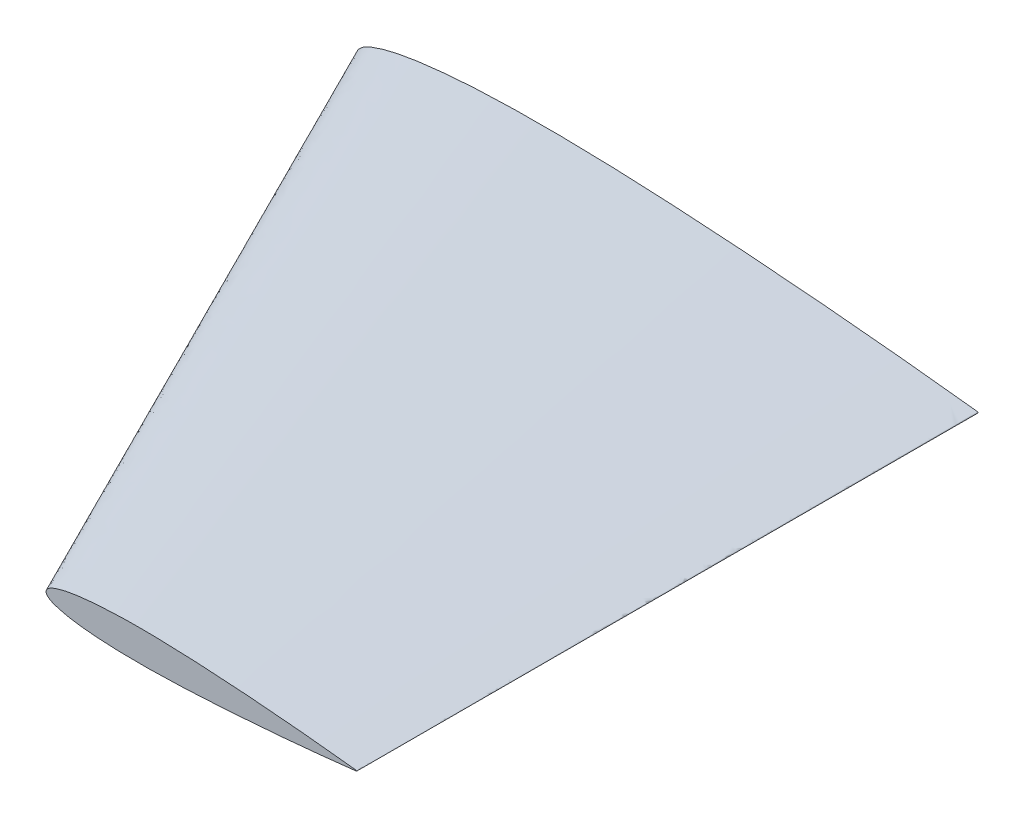
ISO-10303-21;
HEADER;
FILE_DESCRIPTION(('STEP AP214'),'2;1');
FILE_NAME('part.step','',(''),(''),'','','');
FILE_SCHEMA(('AUTOMOTIVE_DESIGN { 1 0 10303 214 1 1 1 1 }'));
ENDSEC;
DATA;
#1=APPLICATION_CONTEXT('core data for automotive mechanical design processes');
#2=APPLICATION_PROTOCOL_DEFINITION('international standard','automotive_design',2000,#1);
#3=PRODUCT_CONTEXT('',#1,'mechanical');
#4=PRODUCT('Part','Part','',(#3));
#5=PRODUCT_RELATED_PRODUCT_CATEGORY('part','',(#4));
#6=PRODUCT_DEFINITION_FORMATION('','',#4);
#7=PRODUCT_DEFINITION_CONTEXT('part definition',#1,'design');
#8=PRODUCT_DEFINITION('design','',#6,#7);
#9=PRODUCT_DEFINITION_SHAPE('','',#8);
#10=(LENGTH_UNIT() NAMED_UNIT(*) SI_UNIT(.MILLI.,.METRE.));
#11=(NAMED_UNIT(*) PLANE_ANGLE_UNIT() SI_UNIT($,.RADIAN.));
#12=(NAMED_UNIT(*) SI_UNIT($,.STERADIAN.) SOLID_ANGLE_UNIT());
#13=UNCERTAINTY_MEASURE_WITH_UNIT(LENGTH_MEASURE(1.E-05),#10,'distance_accuracy_value','');
#14=(GEOMETRIC_REPRESENTATION_CONTEXT(3) GLOBAL_UNCERTAINTY_ASSIGNED_CONTEXT((#13)) GLOBAL_UNIT_ASSIGNED_CONTEXT((#10,
#11,#12)) REPRESENTATION_CONTEXT('',''));
#15=CARTESIAN_POINT('',(0.,0.,0.));
#16=DIRECTION('',(0.,0.,1.));
#17=DIRECTION('',(1.,0.,0.));
#18=AXIS2_PLACEMENT_3D('',#15,#16,#17);
#19=CARTESIAN_POINT('',(99.9880035922591,0.,200.));
#20=DIRECTION('',(0.,0.,-1.));
#21=DIRECTION('',(-1.,0.,0.));
#22=AXIS2_PLACEMENT_3D('',#19,#20,#21);
#23=PLANE('',#22);
#24=CARTESIAN_POINT('',(199.988003592259,0.105,200.));
#25=CARTESIAN_POINT('',(198.321566070237,0.29539299037051,200.));
#26=CARTESIAN_POINT('',(194.989777362142,0.676054855597412,200.));
#27=CARTESIAN_POINT('',(188.324832977309,1.38753827363248,200.));
#28=CARTESIAN_POINT('',(179.992978200059,2.20217503777529,200.));
#29=CARTESIAN_POINT('',(169.992816568424,3.07411855616714,200.));
#30=CARTESIAN_POINT('',(159.992930711742,3.8289788496319,200.));
#31=CARTESIAN_POINT('',(149.992598890218,4.43797959820881,200.));
#32=CARTESIAN_POINT('',(139.992080610179,4.87766101565851,200.));
#33=CARTESIAN_POINT('',(131.655116581409,5.03018562008492,200.));
#34=CARTESIAN_POINT('',(124.986705080723,4.97011686452005,200.));
#35=CARTESIAN_POINT('',(119.984473263032,4.80414952889834,200.));
#36=CARTESIAN_POINT('',(114.977976518171,4.49198475948207,200.));
#37=CARTESIAN_POINT('',(110.810517860258,4.04300538643148,200.));
#38=CARTESIAN_POINT('',(107.473553513295,3.51901208947982,200.));
#39=CARTESIAN_POINT('',(104.968116669083,2.99534422126428,200.));
#40=CARTESIAN_POINT('',(102.834898031876,2.34432761088269,200.));
#41=CARTESIAN_POINT('',(101.066789196354,1.59919390956959,200.));
#42=CARTESIAN_POINT('',(99.3489969027453,0.,200.));
#43=CARTESIAN_POINT('',(101.066789196354,-1.59919390956958,200.));
#44=CARTESIAN_POINT('',(102.834898031876,-2.34432761088269,200.));
#45=CARTESIAN_POINT('',(104.968116669083,-2.99534422126428,200.));
#46=CARTESIAN_POINT('',(107.473553513295,-3.51901208947983,200.));
#47=CARTESIAN_POINT('',(110.810517860258,-4.04300538643148,200.));
#48=CARTESIAN_POINT('',(114.977976518171,-4.49198475948207,200.));
#49=CARTESIAN_POINT('',(119.984473263032,-4.80414952889834,200.));
#50=CARTESIAN_POINT('',(124.986705080723,-4.97011686452005,200.));
#51=CARTESIAN_POINT('',(131.655116581409,-5.03018562008492,200.));
#52=CARTESIAN_POINT('',(139.992080610179,-4.87766101565851,200.));
#53=CARTESIAN_POINT('',(149.992598890218,-4.43797959820881,200.));
#54=CARTESIAN_POINT('',(159.992930711742,-3.8289788496319,200.));
#55=CARTESIAN_POINT('',(169.992816568424,-3.07411855616714,200.));
#56=CARTESIAN_POINT('',(179.992978200059,-2.20217503777529,200.));
#57=CARTESIAN_POINT('',(188.324832977309,-1.38753827363248,200.));
#58=CARTESIAN_POINT('',(194.989777362142,-0.676054855597412,200.));
#59=CARTESIAN_POINT('',(198.321566070237,-0.29539299037051,200.));
#60=CARTESIAN_POINT('',(199.988003592259,-0.105,200.));
#61=B_SPLINE_CURVE_WITH_KNOTS('',3,(#24,#25,#26,#27,#28,#29,#30,#31,#32,#33,#34,#35,#36,#37,#38,
#39,#40,#41,#42,#43,#44,#45,#46,#47,#48,#49,#50,#51,#52,#53,#54,#55,#56,#57,#58,#59,#60),
.UNSPECIFIED.,.F.,.F.,(4,1,1,1,1,1,1,1,1,1,1,1,1,1,1,1,1,1,1,1,1,1,1,1,1,1,1,1,1,1,1,1,1,1,4),
(0.,0.0248223366809534,0.0496284918991712,0.0991955323846024,0.148712592973171,
0.198181861478955,0.247602780816046,0.296978032937799,0.346315468039783,0.37098206148429,
0.395661674152046,0.420379085012258,0.445195930985613,0.457685471829932,0.470302569071023,
0.483221568029035,0.490061481884537,0.5,0.509938518115463,0.516778431970965,0.529697430928977,
0.542314528170068,0.554804069014387,0.579620914987742,0.604338325847954,0.62901793851571,
0.653684531960217,0.703021967062201,0.752397219183954,0.801818138521045,0.851287407026829,
0.900804467615398,0.950371508100829,0.975177663319047,1.),.UNSPECIFIED.);
#62=CARTESIAN_POINT('',(199.987969589789,0.105003884833238,200.));
#63=VERTEX_POINT('',#62);
#64=CARTESIAN_POINT('',(199.988003592259,-0.105,200.));
#65=VERTEX_POINT('',#64);
#66=EDGE_CURVE('E89',#63,#65,#61,.T.);
#67=ORIENTED_EDGE('',*,*,#66,.T.);
#68=CARTESIAN_POINT('',(199.976007184518,0.,200.));
#69=DIRECTION('',(0.,0.,1.));
#70=DIRECTION('',(1.,0.,0.));
#71=AXIS2_PLACEMENT_3D('',#68,#69,#70);
#72=CIRCLE('',#71,0.105683081894342);
#73=EDGE_CURVE('E12',#65,#63,#72,.T.);
#74=ORIENTED_EDGE('',*,*,#73,.T.);
#75=EDGE_LOOP('',(#67,#74));
#76=FACE_BOUND('',#75,.T.);
#77=ADVANCED_FACE('F79',(#76),#23,.F.);
#78=CARTESIAN_POINT('',(0.,0.,0.));
#79=DIRECTION('',(0.,0.,-1.));
#80=DIRECTION('',(-1.,0.,0.));
#81=AXIS2_PLACEMENT_3D('',#78,#79,#80);
#82=PLANE('',#81);
#83=CARTESIAN_POINT('',(200.,0.21,0.));
#84=CARTESIAN_POINT('',(196.667124955956,0.590785980741021,0.));
#85=CARTESIAN_POINT('',(190.003547539766,1.35210971119482,0.));
#86=CARTESIAN_POINT('',(176.673658770099,2.77507654726496,0.));
#87=CARTESIAN_POINT('',(160.009949215599,4.40435007555059,0.));
#88=CARTESIAN_POINT('',(140.009625952329,6.14823711233428,0.));
#89=CARTESIAN_POINT('',(120.009854238965,7.65795769926381,0.));
#90=CARTESIAN_POINT('',(100.009190595919,8.87595919641762,0.));
#91=CARTESIAN_POINT('',(80.0081540358392,9.75532203131702,0.));
#92=CARTESIAN_POINT('',(63.3342259783001,10.0603712401698,0.));
#93=CARTESIAN_POINT('',(49.9974029769286,9.94023372904009,0.));
#94=CARTESIAN_POINT('',(39.9929393415448,9.60829905779668,0.));
#95=CARTESIAN_POINT('',(29.9799458518234,8.98396951896415,0.));
#96=CARTESIAN_POINT('',(21.6450285359974,8.08601077286296,0.));
#97=CARTESIAN_POINT('',(14.9710998420712,7.03802417895965,0.));
#98=CARTESIAN_POINT('',(9.96022615364733,5.99068844252857,0.));
#99=CARTESIAN_POINT('',(5.69378887923293,4.68865522176539,0.));
#100=CARTESIAN_POINT('',(2.15757120819012,3.19838781913917,0.));
#101=CARTESIAN_POINT('',(-1.27801337902767,0.,0.));
#102=CARTESIAN_POINT('',(2.15757120819012,-3.19838781913916,0.));
#103=CARTESIAN_POINT('',(5.69378887923293,-4.68865522176539,0.));
#104=CARTESIAN_POINT('',(9.9602261536473,-5.99068844252856,0.));
#105=CARTESIAN_POINT('',(14.9710998420712,-7.03802417895965,0.));
#106=CARTESIAN_POINT('',(21.6450285359974,-8.08601077286296,0.));
#107=CARTESIAN_POINT('',(29.9799458518234,-8.98396951896415,0.));
#108=CARTESIAN_POINT('',(39.9929393415448,-9.60829905779668,0.));
#109=CARTESIAN_POINT('',(49.9974029769286,-9.9402337290401,0.));
#110=CARTESIAN_POINT('',(63.3342259783001,-10.0603712401698,0.));
#111=CARTESIAN_POINT('',(80.0081540358392,-9.75532203131702,0.));
#112=CARTESIAN_POINT('',(100.009190595919,-8.87595919641762,0.));
#113=CARTESIAN_POINT('',(120.009854238965,-7.65795769926381,0.));
#114=CARTESIAN_POINT('',(140.009625952329,-6.14823711233428,0.));
#115=CARTESIAN_POINT('',(160.009949215599,-4.40435007555059,0.));
#116=CARTESIAN_POINT('',(176.673658770099,-2.77507654726496,0.));
#117=CARTESIAN_POINT('',(190.003547539766,-1.35210971119482,0.));
#118=CARTESIAN_POINT('',(196.667124955956,-0.59078598074102,0.));
#119=CARTESIAN_POINT('',(200.,-0.21,0.));
#120=B_SPLINE_CURVE_WITH_KNOTS('',3,(#83,#84,#85,#86,#87,#88,#89,#90,#91,#92,#93,#94,#95,#96,
#97,#98,#99,#100,#101,#102,#103,#104,#105,#106,#107,#108,#109,#110,#111,#112,#113,#114,#115,
#116,#117,#118,#119),.UNSPECIFIED.,.F.,.F.,(4,1,1,1,1,1,1,1,1,1,1,1,1,1,1,1,1,1,1,1,1,1,1,1,1,1,
1,1,1,1,1,1,1,1,4),(0.,0.0248223366809534,0.0496284918991712,0.0991955323846024,
0.148712592973171,0.198181861478955,0.247602780816046,0.296978032937799,0.346315468039783,
0.37098206148429,0.395661674152046,0.420379085012258,0.445195930985613,0.457685471829932,
0.470302569071023,0.483221568029035,0.490061481884537,0.5,0.509938518115463,0.516778431970965,
0.529697430928977,0.542314528170068,0.554804069014387,0.579620914987742,0.604338325847954,
0.62901793851571,0.653684531960217,0.703021967062201,0.752397219183954,0.801818138521045,
0.851287407026829,0.900804467615398,0.950371508100829,0.975177663319047,1.),.UNSPECIFIED.);
#121=CARTESIAN_POINT('',(200.,0.21,0.));
#122=VERTEX_POINT('',#121);
#123=CARTESIAN_POINT('',(-0.000260564519563583,0.,0.));
#124=VERTEX_POINT('',#123);
#125=EDGE_CURVE('E114',#122,#124,#120,.T.);
#126=ORIENTED_EDGE('',*,*,#125,.F.);
#127=CARTESIAN_POINT('',(199.976007184518,0.,0.));
#128=DIRECTION('',(0.,0.,1.));
#129=DIRECTION('',(-1.,0.,0.));
#130=AXIS2_PLACEMENT_3D('',#127,#128,#129);
#131=CIRCLE('',#130,0.211366163788681);
#132=CARTESIAN_POINT('',(200.,-0.21,0.));
#133=VERTEX_POINT('',#132);
#134=EDGE_CURVE('E110',#133,#122,#131,.T.);
#135=ORIENTED_EDGE('',*,*,#134,.F.);
#136=CARTESIAN_POINT('',(200.000001023805,-0.209999883028718,0.));
#137=CARTESIAN_POINT('',(200.050996332702,-0.204173592377285,0.));
#138=CARTESIAN_POINT('',(200.148345244364,-0.153822686806117,0.));
#139=CARTESIAN_POINT('',(200.2070403914,0.,0.));
#140=CARTESIAN_POINT('',(200.148345244364,0.15382268680615,0.));
#141=CARTESIAN_POINT('',(200.050996332702,0.204173592377285,0.));
#142=CARTESIAN_POINT('',(195.800720269821,0.68977401772682,0.));
#143=CARTESIAN_POINT('',(187.401641576746,1.64516184982808,0.));
#144=CARTESIAN_POINT('',(174.789671464898,2.956322722872,0.));
#145=CARTESIAN_POINT('',(164.272766230687,3.97893205131052,0.));
#146=CARTESIAN_POINT('',(155.854969345517,4.75205706207707,0.));
#147=CARTESIAN_POINT('',(149.539832633603,5.31175209047963,0.));
#148=CARTESIAN_POINT('',(143.222689879526,5.84857800095904,0.));
#149=CARTESIAN_POINT('',(136.903701624138,6.36307256009138,0.));
#150=CARTESIAN_POINT('',(130.582775851727,6.85331211165239,0.));
#151=CARTESIAN_POINT('',(124.259899708601,7.31768758751045,0.));
#152=CARTESIAN_POINT('',(117.935032822817,7.75417663460387,0.));
#153=CARTESIAN_POINT('',(111.608197401772,8.16114218860283,0.));
#154=CARTESIAN_POINT('',(105.279434318906,8.53699652167882,0.));
#155=CARTESIAN_POINT('',(98.9488261343575,8.8803963573049,0.));
#156=CARTESIAN_POINT('',(92.6164355276056,9.18929401119543,0.));
#157=CARTESIAN_POINT('',(86.2821898370826,9.45773252637092,0.));
#158=CARTESIAN_POINT('',(79.9461566660332,9.68027627810419,0.));
#159=CARTESIAN_POINT('',(73.6085096948666,9.85126068319918,0.));
#160=CARTESIAN_POINT('',(68.3260334882608,9.94507557155931,0.));
#161=CARTESIAN_POINT('',(64.0996348167972,9.98750728512888,0.));
#162=CARTESIAN_POINT('',(60.9297105529412,10.0021186371487,0.));
#163=CARTESIAN_POINT('',(57.759751504648,9.99879219447519,0.));
#164=CARTESIAN_POINT('',(54.5898716036594,9.97588273500311,0.));
#165=CARTESIAN_POINT('',(51.4202158268683,9.93145223878927,0.));
#166=CARTESIAN_POINT('',(48.2509734301157,9.86356203706924,0.));
#167=CARTESIAN_POINT('',(45.0823640405014,9.77056627044224,0.));
#168=CARTESIAN_POINT('',(41.9146515108407,9.65079009429818,0.));
#169=CARTESIAN_POINT('',(38.7481166811116,9.50303503072106,0.));
#170=CARTESIAN_POINT('',(35.5831609882451,9.32445733180193,0.));
#171=CARTESIAN_POINT('',(32.4204425911366,9.10959234759476,0.));
#172=CARTESIAN_POINT('',(29.2607655087164,8.85371909845955,0.));
#173=CARTESIAN_POINT('',(26.105150987173,8.5515731968808,0.));
#174=CARTESIAN_POINT('',(22.9549686275525,8.19704677530317,0.));
#175=CARTESIAN_POINT('',(20.3356946041292,7.85316401904582,0.));
#176=CARTESIAN_POINT('',(18.2448226181427,7.54588565238791,0.));
#177=CARTESIAN_POINT('',(16.6795546913042,7.29651821168803,0.));
#178=CARTESIAN_POINT('',(15.1178610226776,7.02562294961911,0.));
#179=CARTESIAN_POINT('',(13.5605370618068,6.73055698091506,0.));
#180=CARTESIAN_POINT('',(12.0091625285718,6.40548793846242,0.));
#181=CARTESIAN_POINT('',(10.4656928853604,6.04462605014312,0.));
#182=CARTESIAN_POINT('',(8.93226794662752,5.64302189717979,0.));
#183=CARTESIAN_POINT('',(7.41130237937513,5.1965376841113,0.));
#184=CARTESIAN_POINT('',(6.15651571806074,4.78341543529704,0.));
#185=CARTESIAN_POINT('',(5.16286887591329,4.42389832445281,0.));
#186=CARTESIAN_POINT('',(4.42287872259286,4.14005078270344,0.));
#187=CARTESIAN_POINT('',(3.69495169378208,3.82608298409513,0.));
#188=CARTESIAN_POINT('',(2.9889707830442,3.46470723497782,0.));
#189=CARTESIAN_POINT('',(2.31280112864009,3.05039546184951,0.));
#190=CARTESIAN_POINT('',(1.67195968930709,2.58262937535915,0.));
#191=CARTESIAN_POINT('',(1.07545090082835,2.06000076349657,0.));
#192=CARTESIAN_POINT('',(0.546707559185168,1.46578147876433,0.));
#193=CARTESIAN_POINT('',(0.129582414327517,0.788610549639063,0.));
#194=CARTESIAN_POINT('',(-0.065182053943121,0.,0.));
#195=CARTESIAN_POINT('',(0.129582414327572,-0.788610549639218,0.));
#196=CARTESIAN_POINT('',(0.546707559185172,-1.46578147876433,0.));
#197=CARTESIAN_POINT('',(1.07545090082836,-2.0600007634966,0.));
#198=CARTESIAN_POINT('',(1.67195968930709,-2.58262937535915,0.));
#199=CARTESIAN_POINT('',(2.31280112864016,-3.05039546184956,0.));
#200=CARTESIAN_POINT('',(2.98897078304418,-3.46470723497779,0.));
#201=CARTESIAN_POINT('',(3.69495169378215,-3.82608298409517,0.));
#202=CARTESIAN_POINT('',(4.42287872259294,-4.14005078270346,0.));
#203=CARTESIAN_POINT('',(5.16286887591325,-4.42389832445281,0.));
#204=CARTESIAN_POINT('',(6.15651571806091,-4.78341543529709,0.));
#205=CARTESIAN_POINT('',(7.41130237937512,-5.19653768411131,0.));
#206=CARTESIAN_POINT('',(8.93226794662771,-5.64302189717982,0.));
#207=CARTESIAN_POINT('',(10.4656928853605,-6.04462605014315,0.));
#208=CARTESIAN_POINT('',(12.009162528572,-6.40548793846244,0.));
#209=CARTESIAN_POINT('',(13.5605370618069,-6.73055698091511,0.));
#210=CARTESIAN_POINT('',(15.1178610226777,-7.02562294961911,0.));
#211=CARTESIAN_POINT('',(16.6795546913043,-7.29651821168806,0.));
#212=CARTESIAN_POINT('',(18.2448226181427,-7.54588565238792,0.));
#213=CARTESIAN_POINT('',(20.3356946041293,-7.85316401904584,0.));
#214=CARTESIAN_POINT('',(22.9549686275525,-8.19704677530318,0.));
#215=CARTESIAN_POINT('',(26.1051509871731,-8.55157319688081,0.));
#216=CARTESIAN_POINT('',(29.2607655087164,-8.85371909845954,0.));
#217=CARTESIAN_POINT('',(32.4204425911367,-9.10959234759479,0.));
#218=CARTESIAN_POINT('',(35.5831609882452,-9.32445733180191,0.));
#219=CARTESIAN_POINT('',(38.7481166811117,-9.50303503072109,0.));
#220=CARTESIAN_POINT('',(41.9146515108408,-9.65079009429816,0.));
#221=CARTESIAN_POINT('',(45.0823640405014,-9.77056627044227,0.));
#222=CARTESIAN_POINT('',(48.2509734301157,-9.8635620370692,0.));
#223=CARTESIAN_POINT('',(51.4202158268684,-9.9314522387893,0.));
#224=CARTESIAN_POINT('',(54.5898716036594,-9.97588273500308,0.));
#225=CARTESIAN_POINT('',(57.7597515046481,-9.99879219447521,0.));
#226=CARTESIAN_POINT('',(60.9297105529413,-10.0021186371487,0.));
#227=CARTESIAN_POINT('',(64.0996348167972,-9.98750728512887,0.));
#228=CARTESIAN_POINT('',(68.3260334882606,-9.94507557155933,0.));
#229=CARTESIAN_POINT('',(73.6085096948669,-9.85126068319915,0.));
#230=CARTESIAN_POINT('',(79.9461566660332,-9.68027627810421,0.));
#231=CARTESIAN_POINT('',(86.2821898370828,-9.45773252637091,0.));
#232=CARTESIAN_POINT('',(92.6164355276056,-9.18929401119544,0.));
#233=CARTESIAN_POINT('',(98.9488261343578,-8.88039635730488,0.));
#234=CARTESIAN_POINT('',(105.279434318906,-8.53699652167884,0.));
#235=CARTESIAN_POINT('',(111.608197401772,-8.16114218860282,0.));
#236=CARTESIAN_POINT('',(117.935032822817,-7.75417663460386,0.));
#237=CARTESIAN_POINT('',(124.259899708601,-7.31768758751044,0.));
#238=CARTESIAN_POINT('',(130.582775851728,-6.85331211165238,0.));
#239=CARTESIAN_POINT('',(136.903701624138,-6.36307256009137,0.));
#240=CARTESIAN_POINT('',(143.222689879526,-5.84857800095903,0.));
#241=CARTESIAN_POINT('',(149.539832633603,-5.3117520904796,0.));
#242=CARTESIAN_POINT('',(155.854969345518,-4.75205706207708,0.));
#243=CARTESIAN_POINT('',(164.272766230686,-3.97893205131049,0.));
#244=CARTESIAN_POINT('',(174.789671464898,-2.956322722872,0.));
#245=CARTESIAN_POINT('',(187.401641576746,-1.6451618498281,0.));
#246=CARTESIAN_POINT('',(195.800720269821,-0.689774017726812,0.));
#247=CARTESIAN_POINT('',(200.000001023805,-0.209999883028718,0.));
#248=B_SPLINE_CURVE_WITH_KNOTS('',3,(#136,#137,#138,#139,#140,#141,#142,#143,#144,#145,#146,
#147,#148,#149,#150,#151,#152,#153,#154,#155,#156,#157,#158,#159,#160,#161,#162,#163,#164,#165,
#166,#167,#168,#169,#170,#171,#172,#173,#174,#175,#176,#177,#178,#179,#180,#181,#182,#183,#184,
#185,#186,#187,#188,#189,#190,#191,#192,#193,#194,#195,#196,#197,#198,#199,#200,#201,#202,#203,
#204,#205,#206,#207,#208,#209,#210,#211,#212,#213,#214,#215,#216,#217,#218,#219,#220,#221,#222,
#223,#224,#225,#226,#227,#228,#229,#230,#231,#232,#233,#234,#235,#236,#237,#238,#239,#240,#241,
#242,#243,#244,#245,#246,#247),.UNSPECIFIED.,.T.,.F.,(4,1,1,1,2,1,1,1,1,1,1,1,1,1,1,1,1,1,1,1,1,
1,1,1,1,1,1,1,1,1,1,1,1,1,1,1,1,1,1,1,1,1,1,1,1,1,1,1,1,1,1,1,1,1,1,1,1,1,1,1,1,1,1,1,1,1,1,1,1,
1,1,1,1,1,1,1,1,1,1,1,1,1,1,1,1,1,1,1,1,1,1,1,1,1,1,1,1,1,1,1,1,1,1,1,1,1,1,1,4),(0.,
0.000378919178944327,0.000757838357888653,0.00113675753683298,0.00151567671577731,
0.0327183118184093,0.0639209469210412,0.0951235820236732,0.110724899574989,0.126326217126305,
0.141927534677621,0.157528852228937,0.173130169780253,0.188731487331569,0.204332804882885,
0.219934122434201,0.235535439985517,0.251136757536833,0.266738075088149,0.282339392639465,
0.297940710190781,0.313542027742097,0.329143345293413,0.336944004069071,0.344744662844729,
0.352545321620387,0.360345980396045,0.368146639171703,0.375947297947361,0.383747956723019,
0.391548615498677,0.399349274274335,0.407149933049993,0.414950591825651,0.422751250601309,
0.430551909376967,0.438352568152625,0.446153226928283,0.450053556316112,0.453953885703941,
0.45785421509177,0.461754544479599,0.465654873867427,0.469555203255257,0.473455532643086,
0.477355862030915,0.481256191418744,0.483206356112658,0.485156520806573,0.487106685500487,
0.489056850194402,0.491007014888316,0.492957179582231,0.494907344276145,0.49685750897006,
0.498807673663974,0.500757838357889,0.502708003051803,0.504658167745718,0.506608332439632,
0.508558497133546,0.510508661827461,0.512458826521376,0.51440899121529,0.516359155909205,
0.518309320603119,0.520259485297034,0.524159814684863,0.528060144072692,0.531960473460521,
0.535860802848349,0.539761132236179,0.543661461624008,0.547561791011837,0.551462120399665,
0.555362449787494,0.563163108563152,0.570963767338811,0.578764426114469,0.586565084890126,
0.594365743665785,0.602166402441442,0.609967061217101,0.617767719992758,0.625568378768417,
0.633369037544075,0.641169696319733,0.64897035509539,0.656771013871048,0.664571672646706,
0.672372331422364,0.68797364897368,0.703574966524996,0.719176284076312,0.734777601627628,
0.750378919178944,0.76598023673026,0.781581554281576,0.797182871832892,0.812784189384208,
0.828385506935524,0.84398682448684,0.859588142038156,0.875189459589472,0.890790777140788,
0.906392094692104,0.937594729794736,0.968797364897368,1.),.UNSPECIFIED.);
#249=EDGE_CURVE('E83',#124,#133,#248,.T.);
#250=ORIENTED_EDGE('',*,*,#249,.F.);
#251=EDGE_LOOP('',(#126,#135,#250));
#252=FACE_BOUND('',#251,.T.);
#253=ADVANCED_FACE('F123',(#252),#82,.T.);
#254=CARTESIAN_POINT('',(200.000001023805,-0.209999883028718,0.));
#255=CARTESIAN_POINT('',(199.988004104162,-0.104999941514356,200.));
#256=CARTESIAN_POINT('',(200.050996332702,-0.204173592377285,0.));
#257=CARTESIAN_POINT('',(200.01350175861,-0.10208679618864,200.));
#258=CARTESIAN_POINT('',(200.148345244364,-0.153822686806117,0.));
#259=CARTESIAN_POINT('',(200.062162161478,-0.0769668934028221,200.));
#260=CARTESIAN_POINT('',(200.2070403914,0.,0.));
#261=CARTESIAN_POINT('',(200.091536343447,0.000103589004446096,200.));
#262=CARTESIAN_POINT('',(200.148345244364,0.15382268680615,0.));
#263=CARTESIAN_POINT('',(200.062141436305,0.0768984264808553,200.));
#264=CARTESIAN_POINT('',(200.050996332702,0.204173592377285,0.));
#265=CARTESIAN_POINT('',(200.01350175861,0.10208679618864,200.));
#266=CARTESIAN_POINT('',(195.800720269821,0.68977401772682,0.));
#267=CARTESIAN_POINT('',(197.888363727169,0.34488700886341,200.));
#268=CARTESIAN_POINT('',(187.401641576746,1.64516184982808,0.));
#269=CARTESIAN_POINT('',(193.688840798275,0.822685159061327,200.));
#270=CARTESIAN_POINT('',(174.789671464898,2.956322722872,0.));
#271=CARTESIAN_POINT('',(187.382854900005,1.47826785816637,200.));
#272=CARTESIAN_POINT('',(164.272766230687,3.97893205131052,0.));
#273=CARTESIAN_POINT('',(182.124375741065,1.98930470142309,200.));
#274=CARTESIAN_POINT('',(155.854969345517,4.75205706207707,0.));
#275=CARTESIAN_POINT('',(177.915520055276,2.37624111790398,200.));
#276=CARTESIAN_POINT('',(149.539832633603,5.31175209047963,0.));
#277=CARTESIAN_POINT('',(174.757903882123,2.65565310753778,200.));
#278=CARTESIAN_POINT('',(143.222689879526,5.84857800095904,0.));
#279=CARTESIAN_POINT('',(171.599375070662,2.92443098078008,200.));
#280=CARTESIAN_POINT('',(136.903701624138,6.36307256009138,0.));
#281=CARTESIAN_POINT('',(168.439857211284,3.1814569207588,200.));
#282=CARTESIAN_POINT('',(130.582775851727,6.85331211165239,0.));
#283=CARTESIAN_POINT('',(165.2794093018,3.42669771800326,200.));
#284=CARTESIAN_POINT('',(124.259899708601,7.31768758751045,0.));
#285=CARTESIAN_POINT('',(162.117965291607,3.65882116801679,200.));
#286=CARTESIAN_POINT('',(117.935032822817,7.75417663460387,0.));
#287=CARTESIAN_POINT('',(158.955536709845,3.87709653673808,200.));
#288=CARTESIAN_POINT('',(111.608197401772,8.16114218860283,0.));
#289=CARTESIAN_POINT('',(155.792118536837,4.08056494012067,200.));
#290=CARTESIAN_POINT('',(105.279434318906,8.53699652167882,0.));
#291=CARTESIAN_POINT('',(152.627739382662,4.26849880055659,200.000000000001));
#292=CARTESIAN_POINT('',(98.9488261343575,8.8803963573049,0.));
#293=CARTESIAN_POINT('',(149.46243661411,4.44019901282084,200.));
#294=CARTESIAN_POINT('',(92.6164355276056,9.18929401119543,0.));
#295=CARTESIAN_POINT('',(146.296242875477,4.59464758998901,200.));
#296=CARTESIAN_POINT('',(86.2821898370826,9.45773252637092,0.));
#297=CARTESIAN_POINT('',(143.129121279769,4.72886188775448,200.));
#298=CARTESIAN_POINT('',(79.9461566660332,9.68027627810419,0.));
#299=CARTESIAN_POINT('',(139.961105336068,4.84014064706498,200.));
#300=CARTESIAN_POINT('',(73.6085096948666,9.85126068319918,0.));
#301=CARTESIAN_POINT('',(136.792283090707,4.92562411898348,200.));
#302=CARTESIAN_POINT('',(68.3260334882608,9.94507557155931,0.));
#303=CARTESIAN_POINT('',(134.15104671382,4.97254601219677,200.));
#304=CARTESIAN_POINT('',(64.0996348167972,9.98750728512888,0.));
#305=CARTESIAN_POINT('',(132.037846971471,4.9937446863723,200.));
#306=CARTESIAN_POINT('',(60.9297105529412,10.0021186371487,0.));
#307=CARTESIAN_POINT('',(130.45288559556,5.00106382232106,200.));
#308=CARTESIAN_POINT('',(57.759751504648,9.99879219447519,0.));
#309=CARTESIAN_POINT('',(128.867906401773,4.99939263910156,200.));
#310=CARTESIAN_POINT('',(54.5898716036594,9.97588273500311,0.));
#311=CARTESIAN_POINT('',(127.282967247722,4.9879427097877,200.));
#312=CARTESIAN_POINT('',(51.4202158268683,9.93145223878927,0.));
#313=CARTESIAN_POINT('',(125.698139876111,4.96572612563354,200.));
#314=CARTESIAN_POINT('',(48.2509734301157,9.86356203706924,0.));
#315=CARTESIAN_POINT('',(124.113519395133,4.93178191368514,200.));
#316=CARTESIAN_POINT('',(45.0823640405014,9.77056627044224,0.));
#317=CARTESIAN_POINT('',(122.5292151956,4.88528496742291,200.));
#318=CARTESIAN_POINT('',(41.9146515108407,9.65079009429818,0.));
#319=CARTESIAN_POINT('',(120.945359641826,4.82539886823756,200.));
#320=CARTESIAN_POINT('',(38.7481166811116,9.50303503072106,0.));
#321=CARTESIAN_POINT('',(119.362093261517,4.75151687422752,200.));
#322=CARTESIAN_POINT('',(35.5831609882451,9.32445733180193,0.));
#323=CARTESIAN_POINT('',(117.77961539268,4.66222984987311,200.));
#324=CARTESIAN_POINT('',(32.4204425911366,9.10959234759476,0.));
#325=CARTESIAN_POINT('',(116.198258000106,4.5547988207138,200.));
#326=CARTESIAN_POINT('',(29.2607655087164,8.85371909845955,0.));
#327=CARTESIAN_POINT('',(114.618418674767,4.42686269425323,200.));
#328=CARTESIAN_POINT('',(26.105150987173,8.5515731968808,0.));
#329=CARTESIAN_POINT('',(113.040615499547,4.2757895879369,200.));
#330=CARTESIAN_POINT('',(22.9549686275525,8.19704677530317,0.));
#331=CARTESIAN_POINT('',(111.465519721119,4.0985278801449,200.));
#332=CARTESIAN_POINT('',(20.3356946041292,7.85316401904582,0.));
#333=CARTESIAN_POINT('',(110.15589187695,3.92658735059543,200.));
#334=CARTESIAN_POINT('',(18.2448226181427,7.54588565238791,0.));
#335=CARTESIAN_POINT('',(109.110444565256,3.77294217934653,200.));
#336=CARTESIAN_POINT('',(16.6795546913042,7.29651821168803,0.));
#337=CARTESIAN_POINT('',(108.327815623014,3.64827804733797,200.));
#338=CARTESIAN_POINT('',(15.1178610226776,7.02562294961911,0.));
#339=CARTESIAN_POINT('',(107.546972282008,3.51279978199031,200.000000000001));
#340=CARTESIAN_POINT('',(13.5605370618068,6.73055698091506,0.));
#341=CARTESIAN_POINT('',(106.768297167183,3.36531303393766,199.999999999999));
#342=CARTESIAN_POINT('',(12.0091625285718,6.40548793846242,0.));
#343=CARTESIAN_POINT('',(105.992637535826,3.20270590902585,200.000000000001));
#344=CARTESIAN_POINT('',(10.4656928853604,6.04462605014312,0.));
#345=CARTESIAN_POINT('',(105.220846525087,3.02241827760081,199.999999999999));
#346=CARTESIAN_POINT('',(8.93226794662752,5.64302189717979,0.));
#347=CARTESIAN_POINT('',(104.454251054355,2.82133462408993,200.));
#348=CARTESIAN_POINT('',(7.41130237937513,5.1965376841113,0.));
#349=CARTESIAN_POINT('',(103.693546828621,2.5986360346953,200.));
#350=CARTESIAN_POINT('',(6.15651571806074,4.78341543529704,0.));
#351=CARTESIAN_POINT('',(103.066568092107,2.3910693925768,200.));
#352=CARTESIAN_POINT('',(5.16286887591329,4.42389832445281,0.));
#353=CARTESIAN_POINT('',(102.569178321062,2.21268558651026,200.));
#354=CARTESIAN_POINT('',(4.42287872259286,4.14005078270344,0.));
#355=CARTESIAN_POINT('',(102.199721022293,2.06945150440862,200.));
#356=CARTESIAN_POINT('',(3.69495169378208,3.82608298409513,0.));
#357=CARTESIAN_POINT('',(101.835337173467,1.91349021338934,200.));
#358=CARTESIAN_POINT('',(2.9889707830442,3.46470723497782,0.));
#359=CARTESIAN_POINT('',(101.482620362921,1.73213624357305,200.));
#360=CARTESIAN_POINT('',(2.31280112864009,3.05039546184951,0.));
#361=CARTESIAN_POINT('',(101.14438901915,1.52533673550768,200.));
#362=CARTESIAN_POINT('',(1.67195968930709,2.58262937535915,0.));
#363=CARTESIAN_POINT('',(100.824024354162,1.29131280107769,200.));
#364=CARTESIAN_POINT('',(1.07545090082835,2.06000076349657,0.));
#365=CARTESIAN_POINT('',(100.525753386816,1.0300591430016,200.));
#366=CARTESIAN_POINT('',(0.546707559185168,1.46578147876433,0.));
#367=CARTESIAN_POINT('',(100.261406453818,0.732782860178637,200.));
#368=CARTESIAN_POINT('',(0.129582414327517,0.788610549639063,0.));
#369=CARTESIAN_POINT('',(100.052742761529,0.39435914919352,200.));
#370=CARTESIAN_POINT('',(-0.065182053943121,0.,0.));
#371=CARTESIAN_POINT('',(99.9554573367675,-1.5672142403278E-13,200.));
#372=CARTESIAN_POINT('',(0.129582414327572,-0.788610549639218,0.));
#373=CARTESIAN_POINT('',(100.052742761529,-0.394359149193748,200.));
#374=CARTESIAN_POINT('',(0.546707559185172,-1.46578147876433,0.));
#375=CARTESIAN_POINT('',(100.261406453818,-0.732782860178859,200.));
#376=CARTESIAN_POINT('',(1.07545090082836,-2.0600007634966,0.));
#377=CARTESIAN_POINT('',(100.525753386817,-1.03005914300179,200.));
#378=CARTESIAN_POINT('',(1.67195968930709,-2.58262937535915,0.));
#379=CARTESIAN_POINT('',(100.824024354162,-1.29131280107785,200.));
#380=CARTESIAN_POINT('',(2.31280112864016,-3.05039546184956,0.));
#381=CARTESIAN_POINT('',(101.14438901915,-1.5253367355078,200.));
#382=CARTESIAN_POINT('',(2.98897078304418,-3.46470723497779,0.));
#383=CARTESIAN_POINT('',(101.482620362921,-1.73213624357315,200.));
#384=CARTESIAN_POINT('',(3.69495169378215,-3.82608298409517,0.));
#385=CARTESIAN_POINT('',(101.835337173467,-1.91349021338943,200.));
#386=CARTESIAN_POINT('',(4.42287872259294,-4.14005078270346,0.));
#387=CARTESIAN_POINT('',(102.199721022293,-2.0694515044087,200.));
#388=CARTESIAN_POINT('',(5.16286887591325,-4.42389832445281,0.));
#389=CARTESIAN_POINT('',(102.569178321063,-2.21268558651033,200.));
#390=CARTESIAN_POINT('',(6.15651571806091,-4.78341543529709,0.));
#391=CARTESIAN_POINT('',(103.066568092107,-2.39106939257686,200.));
#392=CARTESIAN_POINT('',(7.41130237937512,-5.19653768411131,0.));
#393=CARTESIAN_POINT('',(103.693546828622,-2.59863603469537,200.));
#394=CARTESIAN_POINT('',(8.93226794662771,-5.64302189717982,0.));
#395=CARTESIAN_POINT('',(104.454251054355,-2.82133462408998,200.));
#396=CARTESIAN_POINT('',(10.4656928853605,-6.04462605014315,0.));
#397=CARTESIAN_POINT('',(105.220846525087,-3.02241827760086,200.));
#398=CARTESIAN_POINT('',(12.009162528572,-6.40548793846244,0.));
#399=CARTESIAN_POINT('',(105.992637535826,-3.20270590902587,200.));
#400=CARTESIAN_POINT('',(13.5605370618069,-6.73055698091511,0.));
#401=CARTESIAN_POINT('',(106.768297167184,-3.3653130339377,200.));
#402=CARTESIAN_POINT('',(15.1178610226777,-7.02562294961911,0.));
#403=CARTESIAN_POINT('',(107.546972282008,-3.51279978199032,200.));
#404=CARTESIAN_POINT('',(16.6795546913043,-7.29651821168806,0.));
#405=CARTESIAN_POINT('',(108.327815623015,-3.648278047338,200.));
#406=CARTESIAN_POINT('',(18.2448226181427,-7.54588565238792,0.));
#407=CARTESIAN_POINT('',(109.110444565257,-3.77294217934655,200.));
#408=CARTESIAN_POINT('',(20.3356946041293,-7.85316401904584,0.));
#409=CARTESIAN_POINT('',(110.15589187695,-3.92658735059543,200.));
#410=CARTESIAN_POINT('',(22.9549686275525,-8.19704677530318,0.));
#411=CARTESIAN_POINT('',(111.46551972112,-4.09852788014492,200.));
#412=CARTESIAN_POINT('',(26.1051509871731,-8.55157319688081,0.));
#413=CARTESIAN_POINT('',(113.040615499547,-4.27578958793691,200.));
#414=CARTESIAN_POINT('',(29.2607655087164,-8.85371909845954,0.));
#415=CARTESIAN_POINT('',(114.618418674767,-4.42686269425324,200.));
#416=CARTESIAN_POINT('',(32.4204425911367,-9.10959234759479,0.));
#417=CARTESIAN_POINT('',(116.198258000106,-4.5547988207138,200.));
#418=CARTESIAN_POINT('',(35.5831609882452,-9.32445733180191,0.));
#419=CARTESIAN_POINT('',(117.77961539268,-4.66222984987311,200.));
#420=CARTESIAN_POINT('',(38.7481166811117,-9.50303503072109,0.));
#421=CARTESIAN_POINT('',(119.362093261517,-4.75151687422753,200.));
#422=CARTESIAN_POINT('',(41.9146515108408,-9.65079009429816,0.));
#423=CARTESIAN_POINT('',(120.945359641826,-4.82539886823757,200.));
#424=CARTESIAN_POINT('',(45.0823640405014,-9.77056627044227,0.));
#425=CARTESIAN_POINT('',(122.529215195601,-4.88528496742292,200.));
#426=CARTESIAN_POINT('',(48.2509734301157,-9.8635620370692,0.));
#427=CARTESIAN_POINT('',(124.113519395133,-4.93178191368513,200.));
#428=CARTESIAN_POINT('',(51.4202158268684,-9.9314522387893,0.));
#429=CARTESIAN_POINT('',(125.698139876111,-4.96572612563355,200.));
#430=CARTESIAN_POINT('',(54.5898716036594,-9.97588273500308,0.));
#431=CARTESIAN_POINT('',(127.282967247722,-4.98794270978771,200.));
#432=CARTESIAN_POINT('',(57.7597515046481,-9.99879219447521,0.));
#433=CARTESIAN_POINT('',(128.867906401773,-4.99939263910156,200.));
#434=CARTESIAN_POINT('',(60.9297105529413,-10.0021186371487,0.));
#435=CARTESIAN_POINT('',(130.452885595561,-5.00106382232106,200.));
#436=CARTESIAN_POINT('',(64.0996348167972,-9.98750728512887,0.));
#437=CARTESIAN_POINT('',(132.037846971471,-4.9937446863723,200.));
#438=CARTESIAN_POINT('',(68.3260334882606,-9.94507557155933,0.));
#439=CARTESIAN_POINT('',(134.15104671382,-4.97254601219676,200.));
#440=CARTESIAN_POINT('',(73.6085096948669,-9.85126068319915,0.));
#441=CARTESIAN_POINT('',(136.792283090707,-4.92562411898347,200.));
#442=CARTESIAN_POINT('',(79.9461566660332,-9.68027627810421,0.));
#443=CARTESIAN_POINT('',(139.961105336068,-4.84014064706498,200.));
#444=CARTESIAN_POINT('',(86.2821898370828,-9.45773252637091,0.));
#445=CARTESIAN_POINT('',(143.129121279769,-4.72886188775448,200.));
#446=CARTESIAN_POINT('',(92.6164355276056,-9.18929401119544,0.));
#447=CARTESIAN_POINT('',(146.296242875477,-4.59464758998899,200.));
#448=CARTESIAN_POINT('',(98.9488261343578,-8.88039635730488,0.));
#449=CARTESIAN_POINT('',(149.46243661411,-4.44019901282085,200.));
#450=CARTESIAN_POINT('',(105.279434318906,-8.53699652167884,0.));
#451=CARTESIAN_POINT('',(152.627739382662,-4.26849880055657,200.));
#452=CARTESIAN_POINT('',(111.608197401772,-8.16114218860282,0.));
#453=CARTESIAN_POINT('',(155.792118536837,-4.08056494012067,200.000000000001));
#454=CARTESIAN_POINT('',(117.935032822817,-7.75417663460386,0.));
#455=CARTESIAN_POINT('',(158.955536709845,-3.87709653673806,199.999999999999));
#456=CARTESIAN_POINT('',(124.259899708601,-7.31768758751044,0.));
#457=CARTESIAN_POINT('',(162.117965291607,-3.65882116801679,200.));
#458=CARTESIAN_POINT('',(130.582775851728,-6.85331211165238,0.));
#459=CARTESIAN_POINT('',(165.2794093018,-3.42669771800324,200.));
#460=CARTESIAN_POINT('',(136.903701624138,-6.36307256009137,0.));
#461=CARTESIAN_POINT('',(168.439857211284,-3.18145692075879,200.));
#462=CARTESIAN_POINT('',(143.222689879526,-5.84857800095903,0.));
#463=CARTESIAN_POINT('',(171.599375070663,-2.92443098078008,200.));
#464=CARTESIAN_POINT('',(149.539832633603,-5.3117520904796,0.));
#465=CARTESIAN_POINT('',(174.757903882123,-2.65565310753778,200.));
#466=CARTESIAN_POINT('',(155.854969345518,-4.75205706207708,0.));
#467=CARTESIAN_POINT('',(177.915520055276,-2.37624111790398,200.));
#468=CARTESIAN_POINT('',(164.272766230686,-3.97893205131049,0.));
#469=CARTESIAN_POINT('',(182.124375741065,-1.98930470142309,200.));
#470=CARTESIAN_POINT('',(174.789671464898,-2.956322722872,0.));
#471=CARTESIAN_POINT('',(187.382854900006,-1.47826785816636,200.));
#472=CARTESIAN_POINT('',(187.401641576746,-1.6451618498281,0.));
#473=CARTESIAN_POINT('',(193.688840798275,-0.822685159061334,200.));
#474=CARTESIAN_POINT('',(195.800720269821,-0.689774017726812,0.));
#475=CARTESIAN_POINT('',(197.888363727169,-0.34488700886341,200.));
#476=CARTESIAN_POINT('',(200.000001023805,-0.209999883028718,0.));
#477=CARTESIAN_POINT('',(199.988004104162,-0.104999941514356,200.));
#478=B_SPLINE_SURFACE_WITH_KNOTS('',3,1,((#254,#255),(#256,#257),(#258,#259),(#260,#261),(#262,
#263),(#264,#265),(#266,#267),(#268,#269),(#270,#271),(#272,#273),(#274,#275),(#276,#277),(#278,
#279),(#280,#281),(#282,#283),(#284,#285),(#286,#287),(#288,#289),(#290,#291),(#292,#293),(#294,
#295),(#296,#297),(#298,#299),(#300,#301),(#302,#303),(#304,#305),(#306,#307),(#308,#309),(#310,
#311),(#312,#313),(#314,#315),(#316,#317),(#318,#319),(#320,#321),(#322,#323),(#324,#325),(#326,
#327),(#328,#329),(#330,#331),(#332,#333),(#334,#335),(#336,#337),(#338,#339),(#340,#341),(#342,
#343),(#344,#345),(#346,#347),(#348,#349),(#350,#351),(#352,#353),(#354,#355),(#356,#357),(#358,
#359),(#360,#361),(#362,#363),(#364,#365),(#366,#367),(#368,#369),(#370,#371),(#372,#373),(#374,
#375),(#376,#377),(#378,#379),(#380,#381),(#382,#383),(#384,#385),(#386,#387),(#388,#389),(#390,
#391),(#392,#393),(#394,#395),(#396,#397),(#398,#399),(#400,#401),(#402,#403),(#404,#405),(#406,
#407),(#408,#409),(#410,#411),(#412,#413),(#414,#415),(#416,#417),(#418,#419),(#420,#421),(#422,
#423),(#424,#425),(#426,#427),(#428,#429),(#430,#431),(#432,#433),(#434,#435),(#436,#437),(#438,
#439),(#440,#441),(#442,#443),(#444,#445),(#446,#447),(#448,#449),(#450,#451),(#452,#453),(#454,
#455),(#456,#457),(#458,#459),(#460,#461),(#462,#463),(#464,#465),(#466,#467),(#468,#469),(#470,
#471),(#472,#473),(#474,#475),(#476,#477)),.UNSPECIFIED.,.T.,.F.,.F.,(4,1,1,1,2,1,1,1,1,1,1,1,1,
1,1,1,1,1,1,1,1,1,1,1,1,1,1,1,1,1,1,1,1,1,1,1,1,1,1,1,1,1,1,1,1,1,1,1,1,1,1,1,1,1,1,1,1,1,1,1,1,
1,1,1,1,1,1,1,1,1,1,1,1,1,1,1,1,1,1,1,1,1,1,1,1,1,1,1,1,1,1,1,1,1,1,1,1,1,1,1,1,1,1,1,1,1,1,1,
4),(2,2),(0.,0.000378919178944327,0.000757838357888653,0.00113675753683298,0.00151567671577731,
0.0327183118184093,0.0639209469210412,0.0951235820236732,0.110724899574989,0.126326217126305,
0.141927534677621,0.157528852228937,0.173130169780253,0.188731487331569,0.204332804882885,
0.219934122434201,0.235535439985517,0.251136757536833,0.266738075088149,0.282339392639465,
0.297940710190781,0.313542027742097,0.329143345293413,0.336944004069071,0.344744662844729,
0.352545321620387,0.360345980396045,0.368146639171703,0.375947297947361,0.383747956723019,
0.391548615498677,0.399349274274335,0.407149933049993,0.414950591825651,0.422751250601309,
0.430551909376967,0.438352568152625,0.446153226928283,0.450053556316112,0.453953885703941,
0.45785421509177,0.461754544479599,0.465654873867427,0.469555203255257,0.473455532643086,
0.477355862030915,0.481256191418744,0.483206356112658,0.485156520806573,0.487106685500487,
0.489056850194402,0.491007014888316,0.492957179582231,0.494907344276145,0.49685750897006,
0.498807673663974,0.500757838357889,0.502708003051803,0.504658167745718,0.506608332439632,
0.508558497133546,0.510508661827461,0.512458826521376,0.51440899121529,0.516359155909205,
0.518309320603119,0.520259485297034,0.524159814684863,0.528060144072692,0.531960473460521,
0.535860802848349,0.539761132236179,0.543661461624008,0.547561791011837,0.551462120399665,
0.555362449787494,0.563163108563152,0.570963767338811,0.578764426114469,0.586565084890126,
0.594365743665785,0.602166402441442,0.609967061217101,0.617767719992758,0.625568378768417,
0.633369037544075,0.641169696319733,0.64897035509539,0.656771013871048,0.664571672646706,
0.672372331422364,0.68797364897368,0.703574966524996,0.719176284076312,0.734777601627628,
0.750378919178944,0.76598023673026,0.781581554281576,0.797182871832892,0.812784189384208,
0.828385506935524,0.84398682448684,0.859588142038156,0.875189459589472,0.890790777140788,
0.906392094692104,0.937594729794736,0.968797364897368,1.),(0.,1.),.UNSPECIFIED.);
#479=ORIENTED_EDGE('',*,*,#134,.T.);
#480=ORIENTED_EDGE('',*,*,#125,.T.);
#481=ORIENTED_EDGE('',*,*,#249,.T.);
#482=EDGE_LOOP('',(#479,#480,#481));
#483=FACE_BOUND('',#482,.T.);
#484=ORIENTED_EDGE('',*,*,#73,.F.);
#485=ORIENTED_EDGE('',*,*,#66,.F.);
#486=EDGE_LOOP('',(#484,#485));
#487=FACE_BOUND('',#486,.T.);
#488=ADVANCED_FACE('F113',(#483,#487),#478,.T.);
#489=CLOSED_SHELL('',(#77,#253,#488));
#490=MANIFOLD_SOLID_BREP('B2',#489);
#491=ADVANCED_BREP_SHAPE_REPRESENTATION('',(#18,#490),#14);
#492=SHAPE_DEFINITION_REPRESENTATION(#9,#491);
ENDSEC;
END-ISO-10303-21;
